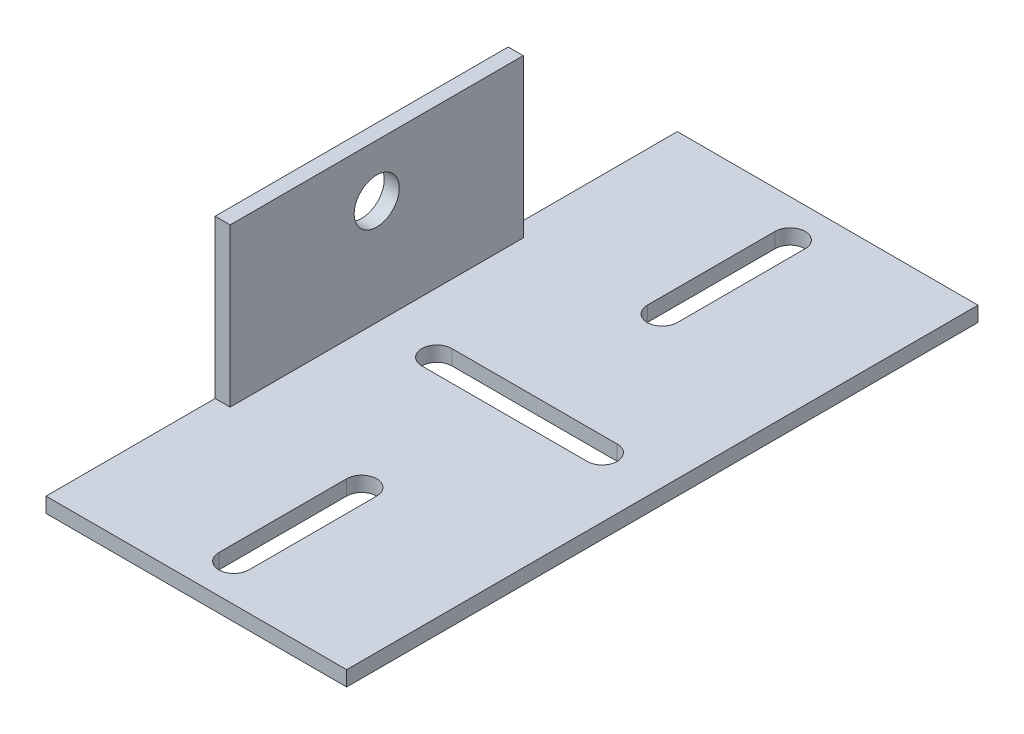
ISO-10303-21;
HEADER;
FILE_DESCRIPTION(('STEP AP214'),'2;1');
FILE_NAME('part.step','',(''),(''),'','','');
FILE_SCHEMA(('AUTOMOTIVE_DESIGN { 1 0 10303 214 1 1 1 1 }'));
ENDSEC;
DATA;
#1=APPLICATION_CONTEXT('core data for automotive mechanical design processes');
#2=APPLICATION_PROTOCOL_DEFINITION('international standard','automotive_design',2000,#1);
#3=PRODUCT_CONTEXT('',#1,'mechanical');
#4=PRODUCT('Part','Part','',(#3));
#5=PRODUCT_RELATED_PRODUCT_CATEGORY('part','',(#4));
#6=PRODUCT_DEFINITION_FORMATION('','',#4);
#7=PRODUCT_DEFINITION_CONTEXT('part definition',#1,'design');
#8=PRODUCT_DEFINITION('design','',#6,#7);
#9=PRODUCT_DEFINITION_SHAPE('','',#8);
#10=(LENGTH_UNIT() NAMED_UNIT(*) SI_UNIT(.MILLI.,.METRE.));
#11=(NAMED_UNIT(*) PLANE_ANGLE_UNIT() SI_UNIT($,.RADIAN.));
#12=(NAMED_UNIT(*) SI_UNIT($,.STERADIAN.) SOLID_ANGLE_UNIT());
#13=UNCERTAINTY_MEASURE_WITH_UNIT(LENGTH_MEASURE(1.E-05),#10,'distance_accuracy_value','');
#14=(GEOMETRIC_REPRESENTATION_CONTEXT(3) GLOBAL_UNCERTAINTY_ASSIGNED_CONTEXT((#13)) GLOBAL_UNIT_ASSIGNED_CONTEXT((#10,
#11,#12)) REPRESENTATION_CONTEXT('',''));
#15=CARTESIAN_POINT('',(0.,0.,0.));
#16=DIRECTION('',(0.,0.,1.));
#17=DIRECTION('',(1.,0.,0.));
#18=AXIS2_PLACEMENT_3D('',#15,#16,#17);
#19=CARTESIAN_POINT('',(0.,0.,84.));
#20=DIRECTION('',(0.,1.,0.));
#21=DIRECTION('',(0.,0.,1.));
#22=AXIS2_PLACEMENT_3D('',#19,#20,#21);
#23=PLANE('',#22);
#24=DIRECTION('',(0.,0.,-1.));
#25=VECTOR('',#24,1.);
#26=CARTESIAN_POINT('',(22.,0.,84.));
#27=LINE('',#26,#25);
#28=CARTESIAN_POINT('',(22.,0.,79.));
#29=VERTEX_POINT('',#28);
#30=CARTESIAN_POINT('',(22.,0.,62.));
#31=VERTEX_POINT('',#30);
#32=EDGE_CURVE('E334',#29,#31,#27,.T.);
#33=ORIENTED_EDGE('',*,*,#32,.T.);
#34=CARTESIAN_POINT('',(20.,0.,62.));
#35=DIRECTION('',(0.,1.,0.));
#36=DIRECTION('',(0.,0.,1.));
#37=AXIS2_PLACEMENT_3D('',#34,#35,#36);
#38=CIRCLE('',#37,2.);
#39=CARTESIAN_POINT('',(18.,0.,62.));
#40=VERTEX_POINT('',#39);
#41=EDGE_CURVE('E337',#31,#40,#38,.T.);
#42=ORIENTED_EDGE('',*,*,#41,.T.);
#43=DIRECTION('',(0.,0.,1.));
#44=VECTOR('',#43,1.);
#45=CARTESIAN_POINT('',(18.,0.,84.));
#46=LINE('',#45,#44);
#47=CARTESIAN_POINT('',(18.,0.,79.));
#48=VERTEX_POINT('',#47);
#49=EDGE_CURVE('E328',#40,#48,#46,.T.);
#50=ORIENTED_EDGE('',*,*,#49,.T.);
#51=CARTESIAN_POINT('',(20.,0.,79.));
#52=DIRECTION('',(0.,1.,0.));
#53=DIRECTION('',(0.,0.,1.));
#54=AXIS2_PLACEMENT_3D('',#51,#52,#53);
#55=CIRCLE('',#54,2.);
#56=EDGE_CURVE('E331',#48,#29,#55,.T.);
#57=ORIENTED_EDGE('',*,*,#56,.T.);
#58=EDGE_LOOP('',(#33,#42,#50,#57));
#59=FACE_BOUND('',#58,.T.);
#60=DIRECTION('',(0.,0.,-1.));
#61=VECTOR('',#60,1.);
#62=CARTESIAN_POINT('',(22.,0.,84.));
#63=LINE('',#62,#61);
#64=CARTESIAN_POINT('',(22.,0.,22.));
#65=VERTEX_POINT('',#64);
#66=CARTESIAN_POINT('',(22.,0.,5.00000000000002));
#67=VERTEX_POINT('',#66);
#68=EDGE_CURVE('E322',#65,#67,#63,.T.);
#69=ORIENTED_EDGE('',*,*,#68,.T.);
#70=CARTESIAN_POINT('',(20.,0.,5.00000000000002));
#71=DIRECTION('',(0.,1.,0.));
#72=DIRECTION('',(0.,0.,1.));
#73=AXIS2_PLACEMENT_3D('',#70,#71,#72);
#74=CIRCLE('',#73,2.);
#75=CARTESIAN_POINT('',(18.,0.,5.00000000000002));
#76=VERTEX_POINT('',#75);
#77=EDGE_CURVE('E325',#67,#76,#74,.T.);
#78=ORIENTED_EDGE('',*,*,#77,.T.);
#79=DIRECTION('',(0.,0.,1.));
#80=VECTOR('',#79,1.);
#81=CARTESIAN_POINT('',(18.,0.,84.));
#82=LINE('',#81,#80);
#83=CARTESIAN_POINT('',(18.,0.,22.));
#84=VERTEX_POINT('',#83);
#85=EDGE_CURVE('E316',#76,#84,#82,.T.);
#86=ORIENTED_EDGE('',*,*,#85,.T.);
#87=CARTESIAN_POINT('',(20.,0.,22.));
#88=DIRECTION('',(0.,1.,0.));
#89=DIRECTION('',(0.,0.,1.));
#90=AXIS2_PLACEMENT_3D('',#87,#88,#89);
#91=CIRCLE('',#90,2.);
#92=EDGE_CURVE('E319',#84,#65,#91,.T.);
#93=ORIENTED_EDGE('',*,*,#92,.T.);
#94=EDGE_LOOP('',(#69,#78,#86,#93));
#95=FACE_BOUND('',#94,.T.);
#96=DIRECTION('',(1.,0.,0.));
#97=VECTOR('',#96,1.);
#98=CARTESIAN_POINT('',(0.,0.,44.));
#99=LINE('',#98,#97);
#100=CARTESIAN_POINT('',(10.,0.,44.));
#101=VERTEX_POINT('',#100);
#102=CARTESIAN_POINT('',(32.,0.,44.));
#103=VERTEX_POINT('',#102);
#104=EDGE_CURVE('E310',#101,#103,#99,.T.);
#105=ORIENTED_EDGE('',*,*,#104,.T.);
#106=CARTESIAN_POINT('',(32.,0.,42.));
#107=DIRECTION('',(0.,1.,0.));
#108=DIRECTION('',(0.,0.,1.));
#109=AXIS2_PLACEMENT_3D('',#106,#107,#108);
#110=CIRCLE('',#109,1.99999999999999);
#111=CARTESIAN_POINT('',(32.,0.,40.));
#112=VERTEX_POINT('',#111);
#113=EDGE_CURVE('E313',#103,#112,#110,.T.);
#114=ORIENTED_EDGE('',*,*,#113,.T.);
#115=DIRECTION('',(-1.,0.,0.));
#116=VECTOR('',#115,1.);
#117=CARTESIAN_POINT('',(0.,0.,40.));
#118=LINE('',#117,#116);
#119=CARTESIAN_POINT('',(10.,0.,40.));
#120=VERTEX_POINT('',#119);
#121=EDGE_CURVE('E298',#112,#120,#118,.T.);
#122=ORIENTED_EDGE('',*,*,#121,.T.);
#123=CARTESIAN_POINT('',(10.,0.,42.));
#124=DIRECTION('',(0.,1.,0.));
#125=DIRECTION('',(0.,0.,1.));
#126=AXIS2_PLACEMENT_3D('',#123,#124,#125);
#127=CIRCLE('',#126,1.99999999999999);
#128=EDGE_CURVE('E307',#120,#101,#127,.T.);
#129=ORIENTED_EDGE('',*,*,#128,.T.);
#130=EDGE_LOOP('',(#105,#114,#122,#129));
#131=FACE_BOUND('',#130,.T.);
#132=DIRECTION('',(1.,0.,0.));
#133=VECTOR('',#132,1.);
#134=CARTESIAN_POINT('',(0.,0.,0.));
#135=LINE('',#134,#133);
#136=CARTESIAN_POINT('',(0.,0.,0.));
#137=VERTEX_POINT('',#136);
#138=CARTESIAN_POINT('',(40.,0.,0.));
#139=VERTEX_POINT('',#138);
#140=EDGE_CURVE('E197',#137,#139,#135,.T.);
#141=ORIENTED_EDGE('',*,*,#140,.T.);
#142=DIRECTION('',(0.,0.,-1.));
#143=VECTOR('',#142,1.);
#144=CARTESIAN_POINT('',(40.,0.,84.));
#145=LINE('',#144,#143);
#146=CARTESIAN_POINT('',(40.,0.,84.));
#147=VERTEX_POINT('',#146);
#148=EDGE_CURVE('E11',#147,#139,#145,.T.);
#149=ORIENTED_EDGE('',*,*,#148,.F.);
#150=DIRECTION('',(1.,0.,0.));
#151=VECTOR('',#150,1.);
#152=CARTESIAN_POINT('',(0.,0.,84.));
#153=LINE('',#152,#151);
#154=CARTESIAN_POINT('',(0.,0.,84.));
#155=VERTEX_POINT('',#154);
#156=EDGE_CURVE('E198',#155,#147,#153,.T.);
#157=ORIENTED_EDGE('',*,*,#156,.F.);
#158=DIRECTION('',(0.,0.,-1.));
#159=VECTOR('',#158,1.);
#160=CARTESIAN_POINT('',(0.,0.,84.));
#161=LINE('',#160,#159);
#162=EDGE_CURVE('E204',#155,#137,#161,.T.);
#163=ORIENTED_EDGE('',*,*,#162,.T.);
#164=EDGE_LOOP('',(#141,#149,#157,#163));
#165=FACE_BOUND('',#164,.T.);
#166=ADVANCED_FACE('F35',(#59,#95,#131,#165),#23,.F.);
#167=CARTESIAN_POINT('',(40.,2.,84.));
#168=DIRECTION('',(1.,0.,0.));
#169=DIRECTION('',(0.,0.,-1.));
#170=AXIS2_PLACEMENT_3D('',#167,#168,#169);
#171=PLANE('',#170);
#172=DIRECTION('',(0.,-1.,0.));
#173=VECTOR('',#172,1.);
#174=CARTESIAN_POINT('',(40.,2.,0.));
#175=LINE('',#174,#173);
#176=CARTESIAN_POINT('',(40.,2.,0.));
#177=VERTEX_POINT('',#176);
#178=EDGE_CURVE('E184',#177,#139,#175,.T.);
#179=ORIENTED_EDGE('',*,*,#178,.F.);
#180=DIRECTION('',(0.,0.,-1.));
#181=VECTOR('',#180,1.);
#182=CARTESIAN_POINT('',(40.,2.,84.));
#183=LINE('',#182,#181);
#184=CARTESIAN_POINT('',(40.,2.,84.));
#185=VERTEX_POINT('',#184);
#186=EDGE_CURVE('E42',#185,#177,#183,.T.);
#187=ORIENTED_EDGE('',*,*,#186,.F.);
#188=DIRECTION('',(0.,-1.,0.));
#189=VECTOR('',#188,1.);
#190=CARTESIAN_POINT('',(40.,2.,84.));
#191=LINE('',#190,#189);
#192=EDGE_CURVE('E200',#185,#147,#191,.T.);
#193=ORIENTED_EDGE('',*,*,#192,.T.);
#194=ORIENTED_EDGE('',*,*,#148,.T.);
#195=EDGE_LOOP('',(#179,#187,#193,#194));
#196=FACE_BOUND('',#195,.T.);
#197=ADVANCED_FACE('F345',(#196),#171,.T.);
#198=CARTESIAN_POINT('',(0.,2.,84.));
#199=DIRECTION('',(0.,1.,0.));
#200=DIRECTION('',(0.,0.,1.));
#201=AXIS2_PLACEMENT_3D('',#198,#199,#200);
#202=PLANE('',#201);
#203=DIRECTION('',(0.,0.,-1.));
#204=VECTOR('',#203,1.);
#205=CARTESIAN_POINT('',(2.,2.,84.));
#206=LINE('',#205,#204);
#207=CARTESIAN_POINT('',(2.,2.,61.5));
#208=VERTEX_POINT('',#207);
#209=CARTESIAN_POINT('',(2.,2.,22.5));
#210=VERTEX_POINT('',#209);
#211=EDGE_CURVE('E212',#208,#210,#206,.T.);
#212=ORIENTED_EDGE('',*,*,#211,.F.);
#213=DIRECTION('',(-1.,0.,0.));
#214=VECTOR('',#213,1.);
#215=CARTESIAN_POINT('',(10.,2.,61.5));
#216=LINE('',#215,#214);
#217=CARTESIAN_POINT('',(0.,2.,61.5));
#218=VERTEX_POINT('',#217);
#219=EDGE_CURVE('E192',#208,#218,#216,.T.);
#220=ORIENTED_EDGE('',*,*,#219,.T.);
#221=DIRECTION('',(0.,0.,1.));
#222=VECTOR('',#221,1.);
#223=CARTESIAN_POINT('',(0.,2.00000000000001,84.));
#224=LINE('',#223,#222);
#225=CARTESIAN_POINT('',(0.,2.00000000000001,84.));
#226=VERTEX_POINT('',#225);
#227=EDGE_CURVE('E233',#218,#226,#224,.T.);
#228=ORIENTED_EDGE('',*,*,#227,.T.);
#229=DIRECTION('',(1.,0.,0.));
#230=VECTOR('',#229,1.);
#231=CARTESIAN_POINT('',(0.,2.,84.));
#232=LINE('',#231,#230);
#233=EDGE_CURVE('E49',#226,#185,#232,.T.);
#234=ORIENTED_EDGE('',*,*,#233,.T.);
#235=ORIENTED_EDGE('',*,*,#186,.T.);
#236=DIRECTION('',(1.,0.,0.));
#237=VECTOR('',#236,1.);
#238=CARTESIAN_POINT('',(0.,2.,0.));
#239=LINE('',#238,#237);
#240=CARTESIAN_POINT('',(0.,2.,0.));
#241=VERTEX_POINT('',#240);
#242=EDGE_CURVE('E170',#241,#177,#239,.T.);
#243=ORIENTED_EDGE('',*,*,#242,.F.);
#244=DIRECTION('',(0.,0.,1.));
#245=VECTOR('',#244,1.);
#246=CARTESIAN_POINT('',(0.,2.,0.));
#247=LINE('',#246,#245);
#248=CARTESIAN_POINT('',(0.,2.,22.5));
#249=VERTEX_POINT('',#248);
#250=EDGE_CURVE('E176',#241,#249,#247,.T.);
#251=ORIENTED_EDGE('',*,*,#250,.T.);
#252=DIRECTION('',(-1.,0.,0.));
#253=VECTOR('',#252,1.);
#254=CARTESIAN_POINT('',(10.,2.,22.5));
#255=LINE('',#254,#253);
#256=EDGE_CURVE('E223',#210,#249,#255,.T.);
#257=ORIENTED_EDGE('',*,*,#256,.F.);
#258=EDGE_LOOP('',(#212,#220,#228,#234,#235,#243,#251,#257));
#259=FACE_BOUND('',#258,.T.);
#260=CARTESIAN_POINT('',(20.,2.,62.));
#261=DIRECTION('',(0.,1.,0.));
#262=DIRECTION('',(0.,0.,-1.));
#263=AXIS2_PLACEMENT_3D('',#260,#261,#262);
#264=CIRCLE('',#263,2.);
#265=CARTESIAN_POINT('',(22.,2.,62.));
#266=VERTEX_POINT('',#265);
#267=CARTESIAN_POINT('',(18.,2.,62.));
#268=VERTEX_POINT('',#267);
#269=EDGE_CURVE('E246',#266,#268,#264,.T.);
#270=ORIENTED_EDGE('',*,*,#269,.F.);
#271=DIRECTION('',(0.,0.,-1.));
#272=VECTOR('',#271,1.);
#273=CARTESIAN_POINT('',(22.,2.,79.));
#274=LINE('',#273,#272);
#275=CARTESIAN_POINT('',(22.,2.,79.));
#276=VERTEX_POINT('',#275);
#277=EDGE_CURVE('E275',#276,#266,#274,.T.);
#278=ORIENTED_EDGE('',*,*,#277,.F.);
#279=CARTESIAN_POINT('',(20.,2.,79.));
#280=DIRECTION('',(0.,1.,0.));
#281=DIRECTION('',(0.,0.,1.));
#282=AXIS2_PLACEMENT_3D('',#279,#280,#281);
#283=CIRCLE('',#282,2.);
#284=CARTESIAN_POINT('',(18.,2.,79.));
#285=VERTEX_POINT('',#284);
#286=EDGE_CURVE('E272',#285,#276,#283,.T.);
#287=ORIENTED_EDGE('',*,*,#286,.F.);
#288=DIRECTION('',(0.,0.,1.));
#289=VECTOR('',#288,1.);
#290=CARTESIAN_POINT('',(18.,2.,79.));
#291=LINE('',#290,#289);
#292=EDGE_CURVE('E270',#268,#285,#291,.T.);
#293=ORIENTED_EDGE('',*,*,#292,.F.);
#294=EDGE_LOOP('',(#270,#278,#287,#293));
#295=FACE_BOUND('',#294,.T.);
#296=CARTESIAN_POINT('',(20.,2.,5.00000000000002));
#297=DIRECTION('',(0.,1.,0.));
#298=DIRECTION('',(0.,0.,-1.));
#299=AXIS2_PLACEMENT_3D('',#296,#297,#298);
#300=CIRCLE('',#299,2.);
#301=CARTESIAN_POINT('',(22.,2.,5.00000000000002));
#302=VERTEX_POINT('',#301);
#303=CARTESIAN_POINT('',(18.,2.,5.00000000000002));
#304=VERTEX_POINT('',#303);
#305=EDGE_CURVE('E247',#302,#304,#300,.T.);
#306=ORIENTED_EDGE('',*,*,#305,.F.);
#307=DIRECTION('',(0.,0.,-1.));
#308=VECTOR('',#307,1.);
#309=CARTESIAN_POINT('',(22.,2.,5.00000000000002));
#310=LINE('',#309,#308);
#311=CARTESIAN_POINT('',(22.,2.,22.));
#312=VERTEX_POINT('',#311);
#313=EDGE_CURVE('E256',#312,#302,#310,.T.);
#314=ORIENTED_EDGE('',*,*,#313,.F.);
#315=CARTESIAN_POINT('',(20.,2.,22.));
#316=DIRECTION('',(0.,1.,0.));
#317=DIRECTION('',(0.,0.,1.));
#318=AXIS2_PLACEMENT_3D('',#315,#316,#317);
#319=CIRCLE('',#318,2.);
#320=CARTESIAN_POINT('',(18.,2.,22.));
#321=VERTEX_POINT('',#320);
#322=EDGE_CURVE('E253',#321,#312,#319,.T.);
#323=ORIENTED_EDGE('',*,*,#322,.F.);
#324=DIRECTION('',(0.,0.,1.));
#325=VECTOR('',#324,1.);
#326=CARTESIAN_POINT('',(18.,2.,5.00000000000002));
#327=LINE('',#326,#325);
#328=EDGE_CURVE('E249',#304,#321,#327,.T.);
#329=ORIENTED_EDGE('',*,*,#328,.F.);
#330=EDGE_LOOP('',(#306,#314,#323,#329));
#331=FACE_BOUND('',#330,.T.);
#332=CARTESIAN_POINT('',(32.,2.,42.));
#333=DIRECTION('',(0.,1.,0.));
#334=DIRECTION('',(0.,0.,-1.));
#335=AXIS2_PLACEMENT_3D('',#332,#333,#334);
#336=CIRCLE('',#335,1.99999999999999);
#337=CARTESIAN_POINT('',(32.,2.,44.));
#338=VERTEX_POINT('',#337);
#339=CARTESIAN_POINT('',(32.,2.,40.));
#340=VERTEX_POINT('',#339);
#341=EDGE_CURVE('E262',#338,#340,#336,.T.);
#342=ORIENTED_EDGE('',*,*,#341,.F.);
#343=DIRECTION('',(1.,0.,0.));
#344=VECTOR('',#343,1.);
#345=CARTESIAN_POINT('',(32.,2.,44.));
#346=LINE('',#345,#344);
#347=CARTESIAN_POINT('',(10.,2.,44.));
#348=VERTEX_POINT('',#347);
#349=EDGE_CURVE('E292',#348,#338,#346,.T.);
#350=ORIENTED_EDGE('',*,*,#349,.F.);
#351=CARTESIAN_POINT('',(10.,2.,42.));
#352=DIRECTION('',(0.,1.,0.));
#353=DIRECTION('',(0.,0.,1.));
#354=AXIS2_PLACEMENT_3D('',#351,#352,#353);
#355=CIRCLE('',#354,1.99999999999999);
#356=CARTESIAN_POINT('',(10.,2.,40.));
#357=VERTEX_POINT('',#356);
#358=EDGE_CURVE('E289',#357,#348,#355,.T.);
#359=ORIENTED_EDGE('',*,*,#358,.F.);
#360=DIRECTION('',(-1.,0.,0.));
#361=VECTOR('',#360,1.);
#362=CARTESIAN_POINT('',(32.,2.,40.));
#363=LINE('',#362,#361);
#364=EDGE_CURVE('E286',#340,#357,#363,.T.);
#365=ORIENTED_EDGE('',*,*,#364,.F.);
#366=EDGE_LOOP('',(#342,#350,#359,#365));
#367=FACE_BOUND('',#366,.T.);
#368=ADVANCED_FACE('F173',(#259,#295,#331,#367),#202,.T.);
#369=CARTESIAN_POINT('',(2.,23.,84.));
#370=DIRECTION('',(1.,0.,0.));
#371=DIRECTION('',(0.,1.,0.));
#372=AXIS2_PLACEMENT_3D('',#369,#370,#371);
#373=PLANE('',#372);
#374=DIRECTION('',(0.,-1.,0.));
#375=VECTOR('',#374,1.);
#376=CARTESIAN_POINT('',(2.,23.,22.5));
#377=LINE('',#376,#375);
#378=CARTESIAN_POINT('',(2.,23.,22.5));
#379=VERTEX_POINT('',#378);
#380=EDGE_CURVE('E220',#379,#210,#377,.T.);
#381=ORIENTED_EDGE('',*,*,#380,.F.);
#382=DIRECTION('',(0.,0.,-1.));
#383=VECTOR('',#382,1.);
#384=CARTESIAN_POINT('',(2.,23.,84.));
#385=LINE('',#384,#383);
#386=CARTESIAN_POINT('',(2.,23.,61.5));
#387=VERTEX_POINT('',#386);
#388=EDGE_CURVE('E209',#387,#379,#385,.T.);
#389=ORIENTED_EDGE('',*,*,#388,.F.);
#390=DIRECTION('',(0.,1.,0.));
#391=VECTOR('',#390,1.);
#392=CARTESIAN_POINT('',(2.,23.,61.5));
#393=LINE('',#392,#391);
#394=EDGE_CURVE('E221',#208,#387,#393,.T.);
#395=ORIENTED_EDGE('',*,*,#394,.F.);
#396=ORIENTED_EDGE('',*,*,#211,.T.);
#397=EDGE_LOOP('',(#381,#389,#395,#396));
#398=FACE_BOUND('',#397,.T.);
#399=CARTESIAN_POINT('',(2.,16.,42.));
#400=DIRECTION('',(1.,0.,0.));
#401=DIRECTION('',(0.,1.,0.));
#402=AXIS2_PLACEMENT_3D('',#399,#400,#401);
#403=CIRCLE('',#402,3.);
#404=CARTESIAN_POINT('',(2.,19.,42.));
#405=VERTEX_POINT('',#404);
#406=EDGE_CURVE('E243',#405,#405,#403,.T.);
#407=ORIENTED_EDGE('',*,*,#406,.F.);
#408=EDGE_LOOP('',(#407));
#409=FACE_BOUND('',#408,.T.);
#410=ADVANCED_FACE('F217',(#398,#409),#373,.T.);
#411=CARTESIAN_POINT('',(0.,23.,84.));
#412=DIRECTION('',(0.,1.,0.));
#413=DIRECTION('',(0.,0.,1.));
#414=AXIS2_PLACEMENT_3D('',#411,#412,#413);
#415=PLANE('',#414);
#416=DIRECTION('',(-1.,0.,0.));
#417=VECTOR('',#416,1.);
#418=CARTESIAN_POINT('',(10.,23.,22.5));
#419=LINE('',#418,#417);
#420=CARTESIAN_POINT('',(0.,23.,22.5));
#421=VERTEX_POINT('',#420);
#422=EDGE_CURVE('E225',#379,#421,#419,.T.);
#423=ORIENTED_EDGE('',*,*,#422,.T.);
#424=DIRECTION('',(0.,0.,-1.));
#425=VECTOR('',#424,1.);
#426=CARTESIAN_POINT('',(0.,23.,84.));
#427=LINE('',#426,#425);
#428=CARTESIAN_POINT('',(0.,23.,61.5));
#429=VERTEX_POINT('',#428);
#430=EDGE_CURVE('E206',#429,#421,#427,.T.);
#431=ORIENTED_EDGE('',*,*,#430,.F.);
#432=DIRECTION('',(-1.,0.,0.));
#433=VECTOR('',#432,1.);
#434=CARTESIAN_POINT('',(10.,23.,61.5));
#435=LINE('',#434,#433);
#436=EDGE_CURVE('E235',#387,#429,#435,.T.);
#437=ORIENTED_EDGE('',*,*,#436,.F.);
#438=ORIENTED_EDGE('',*,*,#388,.T.);
#439=EDGE_LOOP('',(#423,#431,#437,#438));
#440=FACE_BOUND('',#439,.T.);
#441=ADVANCED_FACE('F361',(#440),#415,.T.);
#442=CARTESIAN_POINT('',(0.,23.,84.));
#443=DIRECTION('',(1.,0.,0.));
#444=DIRECTION('',(0.,1.,0.));
#445=AXIS2_PLACEMENT_3D('',#442,#443,#444);
#446=PLANE('',#445);
#447=CARTESIAN_POINT('',(0.,16.,42.));
#448=DIRECTION('',(-1.,0.,0.));
#449=DIRECTION('',(0.,0.,1.));
#450=AXIS2_PLACEMENT_3D('',#447,#448,#449);
#451=CIRCLE('',#450,3.);
#452=CARTESIAN_POINT('',(0.,16.,45.));
#453=VERTEX_POINT('',#452);
#454=EDGE_CURVE('E240',#453,#453,#451,.T.);
#455=ORIENTED_EDGE('',*,*,#454,.F.);
#456=EDGE_LOOP('',(#455));
#457=FACE_BOUND('',#456,.T.);
#458=ORIENTED_EDGE('',*,*,#430,.T.);
#459=DIRECTION('',(0.,1.,0.));
#460=VECTOR('',#459,1.);
#461=CARTESIAN_POINT('',(0.,23.,22.5));
#462=LINE('',#461,#460);
#463=EDGE_CURVE('E191',#249,#421,#462,.T.);
#464=ORIENTED_EDGE('',*,*,#463,.F.);
#465=ORIENTED_EDGE('',*,*,#250,.F.);
#466=DIRECTION('',(0.,-1.,0.));
#467=VECTOR('',#466,1.);
#468=CARTESIAN_POINT('',(0.,23.,0.));
#469=LINE('',#468,#467);
#470=EDGE_CURVE('E183',#241,#137,#469,.T.);
#471=ORIENTED_EDGE('',*,*,#470,.T.);
#472=ORIENTED_EDGE('',*,*,#162,.F.);
#473=DIRECTION('',(0.,-1.,0.));
#474=VECTOR('',#473,1.);
#475=CARTESIAN_POINT('',(0.,23.,84.));
#476=LINE('',#475,#474);
#477=EDGE_CURVE('E207',#226,#155,#476,.T.);
#478=ORIENTED_EDGE('',*,*,#477,.F.);
#479=ORIENTED_EDGE('',*,*,#227,.F.);
#480=DIRECTION('',(0.,-1.,0.));
#481=VECTOR('',#480,1.);
#482=CARTESIAN_POINT('',(0.,23.,61.5));
#483=LINE('',#482,#481);
#484=EDGE_CURVE('E231',#429,#218,#483,.T.);
#485=ORIENTED_EDGE('',*,*,#484,.F.);
#486=EDGE_LOOP('',(#458,#464,#465,#471,#472,#478,#479,#485));
#487=FACE_BOUND('',#486,.T.);
#488=ADVANCED_FACE('F188',(#457,#487),#446,.F.);
#489=CARTESIAN_POINT('',(0.,0.,84.));
#490=DIRECTION('',(0.,0.,-1.));
#491=DIRECTION('',(-1.,0.,0.));
#492=AXIS2_PLACEMENT_3D('',#489,#490,#491);
#493=PLANE('',#492);
#494=ORIENTED_EDGE('',*,*,#233,.F.);
#495=ORIENTED_EDGE('',*,*,#477,.T.);
#496=ORIENTED_EDGE('',*,*,#156,.T.);
#497=ORIENTED_EDGE('',*,*,#192,.F.);
#498=EDGE_LOOP('',(#494,#495,#496,#497));
#499=FACE_BOUND('',#498,.T.);
#500=ADVANCED_FACE('F352',(#499),#493,.F.);
#501=CARTESIAN_POINT('',(0.,0.,0.));
#502=DIRECTION('',(0.,0.,-1.));
#503=DIRECTION('',(-1.,0.,0.));
#504=AXIS2_PLACEMENT_3D('',#501,#502,#503);
#505=PLANE('',#504);
#506=ORIENTED_EDGE('',*,*,#470,.F.);
#507=ORIENTED_EDGE('',*,*,#242,.T.);
#508=ORIENTED_EDGE('',*,*,#178,.T.);
#509=ORIENTED_EDGE('',*,*,#140,.F.);
#510=EDGE_LOOP('',(#506,#507,#508,#509));
#511=FACE_BOUND('',#510,.T.);
#512=ADVANCED_FACE('F195',(#511),#505,.T.);
#513=CARTESIAN_POINT('',(32.,-8.,42.));
#514=DIRECTION('',(0.,1.,0.));
#515=DIRECTION('',(0.,0.,1.));
#516=AXIS2_PLACEMENT_3D('',#513,#514,#515);
#517=CYLINDRICAL_SURFACE('',#516,1.99999999999999);
#518=DIRECTION('',(0.,1.,0.));
#519=VECTOR('',#518,1.);
#520=CARTESIAN_POINT('',(32.,-8.,44.));
#521=LINE('',#520,#519);
#522=EDGE_CURVE('E296',#103,#338,#521,.T.);
#523=ORIENTED_EDGE('',*,*,#522,.T.);
#524=ORIENTED_EDGE('',*,*,#341,.T.);
#525=DIRECTION('',(0.,1.,0.));
#526=VECTOR('',#525,1.);
#527=CARTESIAN_POINT('',(32.,-8.,40.));
#528=LINE('',#527,#526);
#529=EDGE_CURVE('E295',#112,#340,#528,.T.);
#530=ORIENTED_EDGE('',*,*,#529,.F.);
#531=ORIENTED_EDGE('',*,*,#113,.F.);
#532=EDGE_LOOP('',(#523,#524,#530,#531));
#533=FACE_BOUND('',#532,.T.);
#534=ADVANCED_FACE('F359',(#533),#517,.F.);
#535=CARTESIAN_POINT('',(32.,-8.,44.));
#536=DIRECTION('',(0.,0.,1.));
#537=DIRECTION('',(1.,0.,0.));
#538=AXIS2_PLACEMENT_3D('',#535,#536,#537);
#539=PLANE('',#538);
#540=DIRECTION('',(0.,1.,0.));
#541=VECTOR('',#540,1.);
#542=CARTESIAN_POINT('',(10.,-8.,44.));
#543=LINE('',#542,#541);
#544=EDGE_CURVE('E299',#101,#348,#543,.T.);
#545=ORIENTED_EDGE('',*,*,#544,.T.);
#546=ORIENTED_EDGE('',*,*,#349,.T.);
#547=ORIENTED_EDGE('',*,*,#522,.F.);
#548=ORIENTED_EDGE('',*,*,#104,.F.);
#549=EDGE_LOOP('',(#545,#546,#547,#548));
#550=FACE_BOUND('',#549,.T.);
#551=ADVANCED_FACE('F376',(#550),#539,.F.);
#552=CARTESIAN_POINT('',(10.,-8.,42.));
#553=DIRECTION('',(0.,1.,0.));
#554=DIRECTION('',(0.,0.,1.));
#555=AXIS2_PLACEMENT_3D('',#552,#553,#554);
#556=CYLINDRICAL_SURFACE('',#555,1.99999999999999);
#557=DIRECTION('',(0.,1.,0.));
#558=VECTOR('',#557,1.);
#559=CARTESIAN_POINT('',(10.,-8.,40.));
#560=LINE('',#559,#558);
#561=EDGE_CURVE('E301',#120,#357,#560,.T.);
#562=ORIENTED_EDGE('',*,*,#561,.T.);
#563=ORIENTED_EDGE('',*,*,#358,.T.);
#564=ORIENTED_EDGE('',*,*,#544,.F.);
#565=ORIENTED_EDGE('',*,*,#128,.F.);
#566=EDGE_LOOP('',(#562,#563,#564,#565));
#567=FACE_BOUND('',#566,.T.);
#568=ADVANCED_FACE('F378',(#567),#556,.F.);
#569=CARTESIAN_POINT('',(32.,-8.,40.));
#570=DIRECTION('',(0.,0.,-1.));
#571=DIRECTION('',(-1.,0.,0.));
#572=AXIS2_PLACEMENT_3D('',#569,#570,#571);
#573=PLANE('',#572);
#574=ORIENTED_EDGE('',*,*,#529,.T.);
#575=ORIENTED_EDGE('',*,*,#364,.T.);
#576=ORIENTED_EDGE('',*,*,#561,.F.);
#577=ORIENTED_EDGE('',*,*,#121,.F.);
#578=EDGE_LOOP('',(#574,#575,#576,#577));
#579=FACE_BOUND('',#578,.T.);
#580=ADVANCED_FACE('F387',(#579),#573,.F.);
#581=CARTESIAN_POINT('',(20.,-8.,5.00000000000002));
#582=DIRECTION('',(0.,1.,0.));
#583=DIRECTION('',(0.,0.,1.));
#584=AXIS2_PLACEMENT_3D('',#581,#582,#583);
#585=CYLINDRICAL_SURFACE('',#584,2.);
#586=DIRECTION('',(0.,1.,0.));
#587=VECTOR('',#586,1.);
#588=CARTESIAN_POINT('',(22.,-8.,5.00000000000002));
#589=LINE('',#588,#587);
#590=EDGE_CURVE('E260',#67,#302,#589,.T.);
#591=ORIENTED_EDGE('',*,*,#590,.T.);
#592=ORIENTED_EDGE('',*,*,#305,.T.);
#593=DIRECTION('',(0.,1.,0.));
#594=VECTOR('',#593,1.);
#595=CARTESIAN_POINT('',(18.,-8.,5.00000000000002));
#596=LINE('',#595,#594);
#597=EDGE_CURVE('E259',#76,#304,#596,.T.);
#598=ORIENTED_EDGE('',*,*,#597,.F.);
#599=ORIENTED_EDGE('',*,*,#77,.F.);
#600=EDGE_LOOP('',(#591,#592,#598,#599));
#601=FACE_BOUND('',#600,.T.);
#602=ADVANCED_FACE('F389',(#601),#585,.F.);
#603=CARTESIAN_POINT('',(22.,-8.,5.00000000000002));
#604=DIRECTION('',(1.,0.,0.));
#605=DIRECTION('',(0.,0.,-1.));
#606=AXIS2_PLACEMENT_3D('',#603,#604,#605);
#607=PLANE('',#606);
#608=DIRECTION('',(0.,1.,0.));
#609=VECTOR('',#608,1.);
#610=CARTESIAN_POINT('',(22.,-8.,22.));
#611=LINE('',#610,#609);
#612=EDGE_CURVE('E263',#65,#312,#611,.T.);
#613=ORIENTED_EDGE('',*,*,#612,.T.);
#614=ORIENTED_EDGE('',*,*,#313,.T.);
#615=ORIENTED_EDGE('',*,*,#590,.F.);
#616=ORIENTED_EDGE('',*,*,#68,.F.);
#617=EDGE_LOOP('',(#613,#614,#615,#616));
#618=FACE_BOUND('',#617,.T.);
#619=ADVANCED_FACE('F395',(#618),#607,.F.);
#620=CARTESIAN_POINT('',(20.,-8.,22.));
#621=DIRECTION('',(0.,1.,0.));
#622=DIRECTION('',(0.,0.,1.));
#623=AXIS2_PLACEMENT_3D('',#620,#621,#622);
#624=CYLINDRICAL_SURFACE('',#623,2.);
#625=DIRECTION('',(0.,1.,0.));
#626=VECTOR('',#625,1.);
#627=CARTESIAN_POINT('',(18.,-8.,22.));
#628=LINE('',#627,#626);
#629=EDGE_CURVE('E265',#84,#321,#628,.T.);
#630=ORIENTED_EDGE('',*,*,#629,.T.);
#631=ORIENTED_EDGE('',*,*,#322,.T.);
#632=ORIENTED_EDGE('',*,*,#612,.F.);
#633=ORIENTED_EDGE('',*,*,#92,.F.);
#634=EDGE_LOOP('',(#630,#631,#632,#633));
#635=FACE_BOUND('',#634,.T.);
#636=ADVANCED_FACE('F426',(#635),#624,.F.);
#637=CARTESIAN_POINT('',(18.,-8.,5.00000000000002));
#638=DIRECTION('',(-1.,0.,0.));
#639=DIRECTION('',(0.,0.,1.));
#640=AXIS2_PLACEMENT_3D('',#637,#638,#639);
#641=PLANE('',#640);
#642=ORIENTED_EDGE('',*,*,#597,.T.);
#643=ORIENTED_EDGE('',*,*,#328,.T.);
#644=ORIENTED_EDGE('',*,*,#629,.F.);
#645=ORIENTED_EDGE('',*,*,#85,.F.);
#646=EDGE_LOOP('',(#642,#643,#644,#645));
#647=FACE_BOUND('',#646,.T.);
#648=ADVANCED_FACE('F411',(#647),#641,.F.);
#649=CARTESIAN_POINT('',(20.,-8.,62.));
#650=DIRECTION('',(0.,1.,0.));
#651=DIRECTION('',(0.,0.,1.));
#652=AXIS2_PLACEMENT_3D('',#649,#650,#651);
#653=CYLINDRICAL_SURFACE('',#652,2.);
#654=DIRECTION('',(0.,1.,0.));
#655=VECTOR('',#654,1.);
#656=CARTESIAN_POINT('',(22.,-8.,62.));
#657=LINE('',#656,#655);
#658=EDGE_CURVE('E250',#31,#266,#657,.T.);
#659=ORIENTED_EDGE('',*,*,#658,.T.);
#660=ORIENTED_EDGE('',*,*,#269,.T.);
#661=DIRECTION('',(0.,1.,0.));
#662=VECTOR('',#661,1.);
#663=CARTESIAN_POINT('',(18.,-8.,62.));
#664=LINE('',#663,#662);
#665=EDGE_CURVE('E278',#40,#268,#664,.T.);
#666=ORIENTED_EDGE('',*,*,#665,.F.);
#667=ORIENTED_EDGE('',*,*,#41,.F.);
#668=EDGE_LOOP('',(#659,#660,#666,#667));
#669=FACE_BOUND('',#668,.T.);
#670=ADVANCED_FACE('F407',(#669),#653,.F.);
#671=CARTESIAN_POINT('',(22.,-8.,79.));
#672=DIRECTION('',(1.,0.,0.));
#673=DIRECTION('',(0.,0.,-1.));
#674=AXIS2_PLACEMENT_3D('',#671,#672,#673);
#675=PLANE('',#674);
#676=DIRECTION('',(0.,1.,0.));
#677=VECTOR('',#676,1.);
#678=CARTESIAN_POINT('',(22.,-8.,79.));
#679=LINE('',#678,#677);
#680=EDGE_CURVE('E280',#29,#276,#679,.T.);
#681=ORIENTED_EDGE('',*,*,#680,.T.);
#682=ORIENTED_EDGE('',*,*,#277,.T.);
#683=ORIENTED_EDGE('',*,*,#658,.F.);
#684=ORIENTED_EDGE('',*,*,#32,.F.);
#685=EDGE_LOOP('',(#681,#682,#683,#684));
#686=FACE_BOUND('',#685,.T.);
#687=ADVANCED_FACE('F410',(#686),#675,.F.);
#688=CARTESIAN_POINT('',(20.,-8.,79.));
#689=DIRECTION('',(0.,1.,0.));
#690=DIRECTION('',(0.,0.,1.));
#691=AXIS2_PLACEMENT_3D('',#688,#689,#690);
#692=CYLINDRICAL_SURFACE('',#691,2.);
#693=DIRECTION('',(0.,1.,0.));
#694=VECTOR('',#693,1.);
#695=CARTESIAN_POINT('',(18.,-8.,79.));
#696=LINE('',#695,#694);
#697=EDGE_CURVE('E57',#48,#285,#696,.T.);
#698=ORIENTED_EDGE('',*,*,#697,.T.);
#699=ORIENTED_EDGE('',*,*,#286,.T.);
#700=ORIENTED_EDGE('',*,*,#680,.F.);
#701=ORIENTED_EDGE('',*,*,#56,.F.);
#702=EDGE_LOOP('',(#698,#699,#700,#701));
#703=FACE_BOUND('',#702,.T.);
#704=ADVANCED_FACE('F417',(#703),#692,.F.);
#705=CARTESIAN_POINT('',(18.,-8.,79.));
#706=DIRECTION('',(-1.,0.,0.));
#707=DIRECTION('',(0.,0.,1.));
#708=AXIS2_PLACEMENT_3D('',#705,#706,#707);
#709=PLANE('',#708);
#710=ORIENTED_EDGE('',*,*,#665,.T.);
#711=ORIENTED_EDGE('',*,*,#292,.T.);
#712=ORIENTED_EDGE('',*,*,#697,.F.);
#713=ORIENTED_EDGE('',*,*,#49,.F.);
#714=EDGE_LOOP('',(#710,#711,#712,#713));
#715=FACE_BOUND('',#714,.T.);
#716=ADVANCED_FACE('F413',(#715),#709,.F.);
#717=CARTESIAN_POINT('',(10.,16.,42.));
#718=DIRECTION('',(-1.,0.,0.));
#719=DIRECTION('',(0.,0.,1.));
#720=AXIS2_PLACEMENT_3D('',#717,#718,#719);
#721=CYLINDRICAL_SURFACE('',#720,3.);
#722=ORIENTED_EDGE('',*,*,#406,.T.);
#723=EDGE_LOOP('',(#722));
#724=FACE_BOUND('',#723,.T.);
#725=ORIENTED_EDGE('',*,*,#454,.T.);
#726=EDGE_LOOP('',(#725));
#727=FACE_BOUND('',#726,.T.);
#728=ADVANCED_FACE('F416',(#724,#727),#721,.F.);
#729=CARTESIAN_POINT('',(10.,23.,22.5));
#730=DIRECTION('',(0.,0.,1.));
#731=DIRECTION('',(0.,-1.,0.));
#732=AXIS2_PLACEMENT_3D('',#729,#730,#731);
#733=PLANE('',#732);
#734=ORIENTED_EDGE('',*,*,#380,.T.);
#735=ORIENTED_EDGE('',*,*,#256,.T.);
#736=ORIENTED_EDGE('',*,*,#463,.T.);
#737=ORIENTED_EDGE('',*,*,#422,.F.);
#738=EDGE_LOOP('',(#734,#735,#736,#737));
#739=FACE_BOUND('',#738,.T.);
#740=ADVANCED_FACE('F436',(#739),#733,.F.);
#741=CARTESIAN_POINT('',(10.,23.,61.5));
#742=DIRECTION('',(0.,0.,-1.));
#743=DIRECTION('',(0.,1.,0.));
#744=AXIS2_PLACEMENT_3D('',#741,#742,#743);
#745=PLANE('',#744);
#746=ORIENTED_EDGE('',*,*,#394,.T.);
#747=ORIENTED_EDGE('',*,*,#436,.T.);
#748=ORIENTED_EDGE('',*,*,#484,.T.);
#749=ORIENTED_EDGE('',*,*,#219,.F.);
#750=EDGE_LOOP('',(#746,#747,#748,#749));
#751=FACE_BOUND('',#750,.T.);
#752=ADVANCED_FACE('F438',(#751),#745,.F.);
#753=CLOSED_SHELL('',(#166,#197,#368,#410,#441,#488,#500,#512,#534,#551,#568,#580,#602,#619,
#636,#648,#670,#687,#704,#716,#728,#740,#752));
#754=MANIFOLD_SOLID_BREP('B2',#753);
#755=ADVANCED_BREP_SHAPE_REPRESENTATION('',(#18,#754),#14);
#756=SHAPE_DEFINITION_REPRESENTATION(#9,#755);
ENDSEC;
END-ISO-10303-21;
